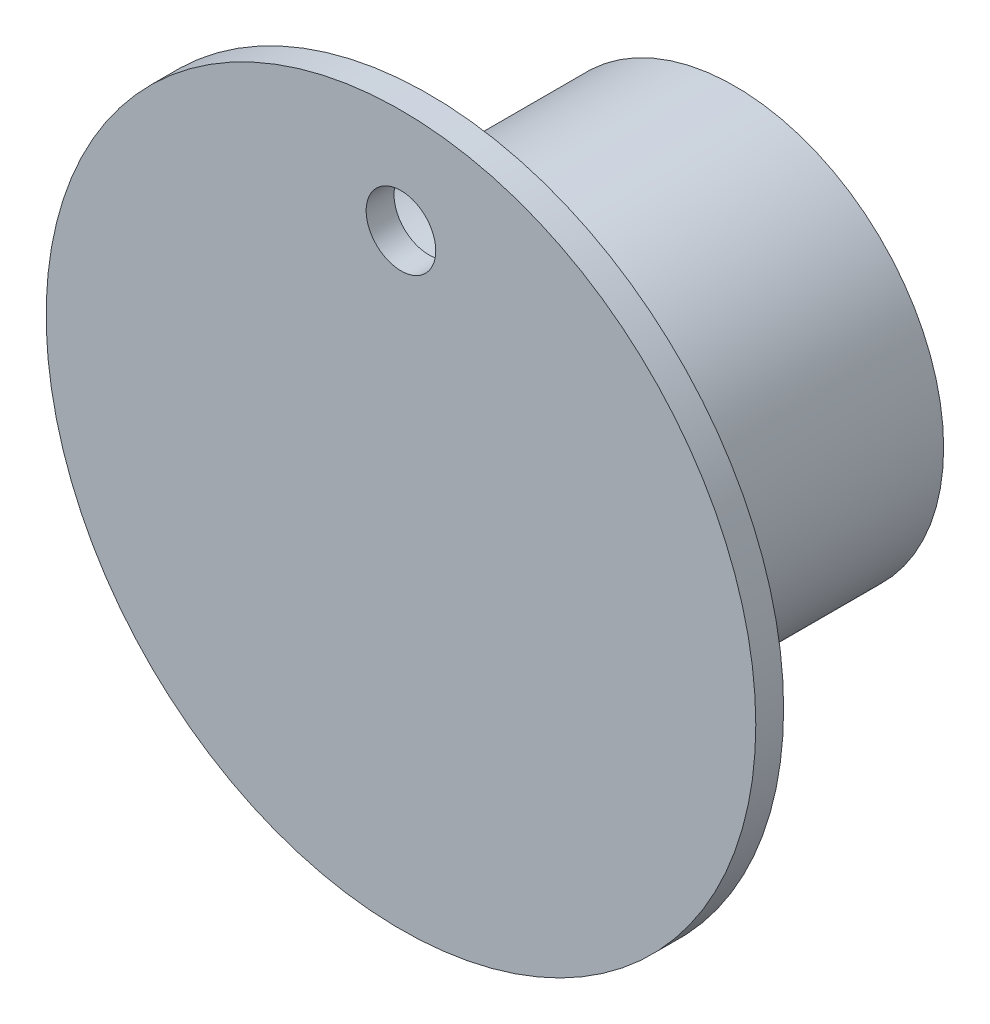
ISO-10303-21;
HEADER;
FILE_DESCRIPTION(('STEP AP214'),'2;1');
FILE_NAME('part.step','',(''),(''),'','','');
FILE_SCHEMA(('AUTOMOTIVE_DESIGN { 1 0 10303 214 1 1 1 1 }'));
ENDSEC;
DATA;
#1=APPLICATION_CONTEXT('core data for automotive mechanical design processes');
#2=APPLICATION_PROTOCOL_DEFINITION('international standard','automotive_design',2000,#1);
#3=PRODUCT_CONTEXT('',#1,'mechanical');
#4=PRODUCT('Part','Part','',(#3));
#5=PRODUCT_RELATED_PRODUCT_CATEGORY('part','',(#4));
#6=PRODUCT_DEFINITION_FORMATION('','',#4);
#7=PRODUCT_DEFINITION_CONTEXT('part definition',#1,'design');
#8=PRODUCT_DEFINITION('design','',#6,#7);
#9=PRODUCT_DEFINITION_SHAPE('','',#8);
#10=(LENGTH_UNIT() NAMED_UNIT(*) SI_UNIT(.MILLI.,.METRE.));
#11=(NAMED_UNIT(*) PLANE_ANGLE_UNIT() SI_UNIT($,.RADIAN.));
#12=(NAMED_UNIT(*) SI_UNIT($,.STERADIAN.) SOLID_ANGLE_UNIT());
#13=UNCERTAINTY_MEASURE_WITH_UNIT(LENGTH_MEASURE(1.E-05),#10,'distance_accuracy_value','');
#14=(GEOMETRIC_REPRESENTATION_CONTEXT(3) GLOBAL_UNCERTAINTY_ASSIGNED_CONTEXT((#13)) GLOBAL_UNIT_ASSIGNED_CONTEXT((#10,
#11,#12)) REPRESENTATION_CONTEXT('',''));
#15=CARTESIAN_POINT('',(0.,0.,0.));
#16=DIRECTION('',(0.,0.,1.));
#17=DIRECTION('',(1.,0.,0.));
#18=AXIS2_PLACEMENT_3D('',#15,#16,#17);
#19=CARTESIAN_POINT('',(0.,0.,2.));
#20=DIRECTION('',(0.,0.,-1.));
#21=DIRECTION('',(-1.,0.,0.));
#22=AXIS2_PLACEMENT_3D('',#19,#20,#21);
#23=CYLINDRICAL_SURFACE('',#22,25.5);
#24=CARTESIAN_POINT('',(0.,0.,2.));
#25=DIRECTION('',(0.,0.,1.));
#26=DIRECTION('',(1.,0.,0.));
#27=AXIS2_PLACEMENT_3D('',#24,#25,#26);
#28=CIRCLE('',#27,25.5);
#29=CARTESIAN_POINT('',(25.5,0.,2.));
#30=VERTEX_POINT('',#29);
#31=EDGE_CURVE('E48',#30,#30,#28,.T.);
#32=ORIENTED_EDGE('',*,*,#31,.F.);
#33=EDGE_LOOP('',(#32));
#34=FACE_BOUND('',#33,.T.);
#35=CARTESIAN_POINT('',(0.,0.,0.));
#36=DIRECTION('',(0.,0.,1.));
#37=DIRECTION('',(1.,0.,0.));
#38=AXIS2_PLACEMENT_3D('',#35,#36,#37);
#39=CIRCLE('',#38,25.5);
#40=CARTESIAN_POINT('',(25.5,0.,0.));
#41=VERTEX_POINT('',#40);
#42=EDGE_CURVE('E53',#41,#41,#39,.T.);
#43=ORIENTED_EDGE('',*,*,#42,.T.);
#44=EDGE_LOOP('',(#43));
#45=FACE_BOUND('',#44,.T.);
#46=ADVANCED_FACE('F41',(#34,#45),#23,.T.);
#47=CARTESIAN_POINT('',(0.,0.,2.));
#48=DIRECTION('',(0.,0.,1.));
#49=DIRECTION('',(1.,0.,0.));
#50=AXIS2_PLACEMENT_3D('',#47,#48,#49);
#51=PLANE('',#50);
#52=CARTESIAN_POINT('',(0.,18.,2.));
#53=DIRECTION('',(0.,0.,1.));
#54=DIRECTION('',(1.,0.,0.));
#55=AXIS2_PLACEMENT_3D('',#52,#53,#54);
#56=CIRCLE('',#55,2.5);
#57=CARTESIAN_POINT('',(2.5,18.,2.));
#58=VERTEX_POINT('',#57);
#59=EDGE_CURVE('E73',#58,#58,#56,.T.);
#60=ORIENTED_EDGE('',*,*,#59,.F.);
#61=EDGE_LOOP('',(#60));
#62=FACE_BOUND('',#61,.T.);
#63=ORIENTED_EDGE('',*,*,#31,.T.);
#64=EDGE_LOOP('',(#63));
#65=FACE_BOUND('',#64,.T.);
#66=ADVANCED_FACE('F91',(#62,#65),#51,.T.);
#67=CARTESIAN_POINT('',(0.,0.,0.));
#68=DIRECTION('',(0.,0.,1.));
#69=DIRECTION('',(1.,0.,0.));
#70=AXIS2_PLACEMENT_3D('',#67,#68,#69);
#71=PLANE('',#70);
#72=CARTESIAN_POINT('',(0.,18.,0.));
#73=DIRECTION('',(0.,0.,1.));
#74=DIRECTION('',(1.,0.,0.));
#75=AXIS2_PLACEMENT_3D('',#72,#73,#74);
#76=CIRCLE('',#75,2.5);
#77=CARTESIAN_POINT('',(2.5,18.,0.));
#78=VERTEX_POINT('',#77);
#79=EDGE_CURVE('E69',#78,#78,#76,.T.);
#80=ORIENTED_EDGE('',*,*,#79,.T.);
#81=EDGE_LOOP('',(#80));
#82=FACE_BOUND('',#81,.T.);
#83=CARTESIAN_POINT('',(0.,0.,0.));
#84=DIRECTION('',(0.,0.,1.));
#85=DIRECTION('',(1.,0.,0.));
#86=AXIS2_PLACEMENT_3D('',#83,#84,#85);
#87=CIRCLE('',#86,15.);
#88=CARTESIAN_POINT('',(15.,0.,0.));
#89=VERTEX_POINT('',#88);
#90=EDGE_CURVE('E10',#89,#89,#87,.F.);
#91=ORIENTED_EDGE('',*,*,#90,.F.);
#92=EDGE_LOOP('',(#91));
#93=FACE_BOUND('',#92,.T.);
#94=ORIENTED_EDGE('',*,*,#42,.F.);
#95=EDGE_LOOP('',(#94));
#96=FACE_BOUND('',#95,.T.);
#97=ADVANCED_FACE('F81',(#82,#93,#96),#71,.F.);
#98=CARTESIAN_POINT('',(0.,0.,-22.));
#99=DIRECTION('',(0.,0.,-1.));
#100=DIRECTION('',(-1.,0.,0.));
#101=AXIS2_PLACEMENT_3D('',#98,#99,#100);
#102=PLANE('',#101);
#103=CARTESIAN_POINT('',(0.,0.,-22.));
#104=DIRECTION('',(0.,0.,-1.));
#105=DIRECTION('',(-1.,0.,0.));
#106=AXIS2_PLACEMENT_3D('',#103,#104,#105);
#107=CIRCLE('',#106,15.);
#108=CARTESIAN_POINT('',(-15.,0.,-22.));
#109=VERTEX_POINT('',#108);
#110=EDGE_CURVE('E59',#109,#109,#107,.T.);
#111=ORIENTED_EDGE('',*,*,#110,.T.);
#112=EDGE_LOOP('',(#111));
#113=FACE_BOUND('',#112,.T.);
#114=CARTESIAN_POINT('',(0.,0.,-22.));
#115=DIRECTION('',(0.,0.,-1.));
#116=DIRECTION('',(-1.,0.,0.));
#117=AXIS2_PLACEMENT_3D('',#114,#115,#116);
#118=CIRCLE('',#117,10.);
#119=CARTESIAN_POINT('',(-10.,0.,-22.));
#120=VERTEX_POINT('',#119);
#121=EDGE_CURVE('E64',#120,#120,#118,.T.);
#122=ORIENTED_EDGE('',*,*,#121,.F.);
#123=EDGE_LOOP('',(#122));
#124=FACE_BOUND('',#123,.T.);
#125=ADVANCED_FACE('F98',(#113,#124),#102,.T.);
#126=CARTESIAN_POINT('',(0.,0.,-22.));
#127=DIRECTION('',(0.,0.,1.));
#128=DIRECTION('',(1.,0.,0.));
#129=AXIS2_PLACEMENT_3D('',#126,#127,#128);
#130=CYLINDRICAL_SURFACE('',#129,15.);
#131=ORIENTED_EDGE('',*,*,#110,.F.);
#132=EDGE_LOOP('',(#131));
#133=FACE_BOUND('',#132,.T.);
#134=ORIENTED_EDGE('',*,*,#90,.T.);
#135=EDGE_LOOP('',(#134));
#136=FACE_BOUND('',#135,.T.);
#137=ADVANCED_FACE('F101',(#133,#136),#130,.T.);
#138=CARTESIAN_POINT('',(0.,0.,-22.));
#139=DIRECTION('',(0.,0.,1.));
#140=DIRECTION('',(1.,0.,0.));
#141=AXIS2_PLACEMENT_3D('',#138,#139,#140);
#142=CYLINDRICAL_SURFACE('',#141,10.);
#143=ORIENTED_EDGE('',*,*,#121,.T.);
#144=EDGE_LOOP('',(#143));
#145=FACE_BOUND('',#144,.T.);
#146=CARTESIAN_POINT('',(0.,0.,0.));
#147=DIRECTION('',(0.,0.,-1.));
#148=DIRECTION('',(-1.,0.,0.));
#149=AXIS2_PLACEMENT_3D('',#146,#147,#148);
#150=CIRCLE('',#149,10.);
#151=CARTESIAN_POINT('',(-10.,0.,0.));
#152=VERTEX_POINT('',#151);
#153=EDGE_CURVE('E65',#152,#152,#150,.T.);
#154=ORIENTED_EDGE('',*,*,#153,.F.);
#155=EDGE_LOOP('',(#154));
#156=FACE_BOUND('',#155,.T.);
#157=ADVANCED_FACE('F104',(#145,#156),#142,.F.);
#158=ORIENTED_EDGE('',*,*,#153,.T.);
#159=EDGE_LOOP('',(#158));
#160=FACE_BOUND('',#159,.T.);
#161=ADVANCED_FACE('F87',(#160),#71,.F.);
#162=CARTESIAN_POINT('',(0.,18.,0.));
#163=DIRECTION('',(0.,0.,1.));
#164=DIRECTION('',(1.,0.,0.));
#165=AXIS2_PLACEMENT_3D('',#162,#163,#164);
#166=CYLINDRICAL_SURFACE('',#165,2.5);
#167=ORIENTED_EDGE('',*,*,#79,.F.);
#168=EDGE_LOOP('',(#167));
#169=FACE_BOUND('',#168,.T.);
#170=ORIENTED_EDGE('',*,*,#59,.T.);
#171=EDGE_LOOP('',(#170));
#172=FACE_BOUND('',#171,.T.);
#173=ADVANCED_FACE('F84',(#169,#172),#166,.F.);
#174=CLOSED_SHELL('',(#46,#66,#97,#125,#137,#157,#161,#173));
#175=MANIFOLD_SOLID_BREP('B2',#174);
#176=ADVANCED_BREP_SHAPE_REPRESENTATION('',(#18,#175),#14);
#177=SHAPE_DEFINITION_REPRESENTATION(#9,#176);
ENDSEC;
END-ISO-10303-21;
